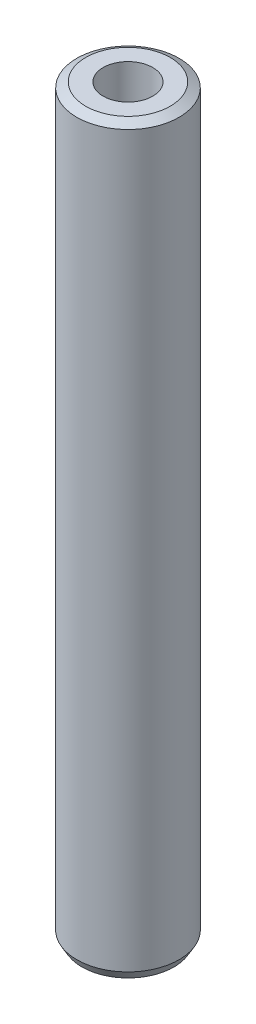
ISO-10303-21;
HEADER;
FILE_DESCRIPTION(('STEP AP214'),'2;1');
FILE_NAME('part.step','',(''),(''),'','','');
FILE_SCHEMA(('AUTOMOTIVE_DESIGN { 1 0 10303 214 1 1 1 1 }'));
ENDSEC;
DATA;
#1=APPLICATION_CONTEXT('core data for automotive mechanical design processes');
#2=APPLICATION_PROTOCOL_DEFINITION('international standard','automotive_design',2000,#1);
#3=PRODUCT_CONTEXT('',#1,'mechanical');
#4=PRODUCT('Part','Part','',(#3));
#5=PRODUCT_RELATED_PRODUCT_CATEGORY('part','',(#4));
#6=PRODUCT_DEFINITION_FORMATION('','',#4);
#7=PRODUCT_DEFINITION_CONTEXT('part definition',#1,'design');
#8=PRODUCT_DEFINITION('design','',#6,#7);
#9=PRODUCT_DEFINITION_SHAPE('','',#8);
#10=(LENGTH_UNIT() NAMED_UNIT(*) SI_UNIT(.MILLI.,.METRE.));
#11=(NAMED_UNIT(*) PLANE_ANGLE_UNIT() SI_UNIT($,.RADIAN.));
#12=(NAMED_UNIT(*) SI_UNIT($,.STERADIAN.) SOLID_ANGLE_UNIT());
#13=UNCERTAINTY_MEASURE_WITH_UNIT(LENGTH_MEASURE(1.E-05),#10,'distance_accuracy_value','');
#14=(GEOMETRIC_REPRESENTATION_CONTEXT(3) GLOBAL_UNCERTAINTY_ASSIGNED_CONTEXT((#13)) GLOBAL_UNIT_ASSIGNED_CONTEXT((#10,
#11,#12)) REPRESENTATION_CONTEXT('',''));
#15=CARTESIAN_POINT('',(0.,0.,0.));
#16=DIRECTION('',(0.,0.,1.));
#17=DIRECTION('',(1.,0.,0.));
#18=AXIS2_PLACEMENT_3D('',#15,#16,#17);
#19=CARTESIAN_POINT('',(0.,72.6724296068115,0.));
#20=DIRECTION('',(0.,-1.,0.));
#21=DIRECTION('',(0.,0.,-1.));
#22=AXIS2_PLACEMENT_3D('',#19,#20,#21);
#23=CYLINDRICAL_SURFACE('',#22,5.);
#24=CARTESIAN_POINT('',(0.,72.1707802732343,0.));
#25=DIRECTION('',(0.,1.,0.));
#26=DIRECTION('',(0.,0.,1.));
#27=AXIS2_PLACEMENT_3D('',#24,#25,#26);
#28=CIRCLE('',#27,5.);
#29=CARTESIAN_POINT('',(0.,72.1707802732343,5.));
#30=VERTEX_POINT('',#29);
#31=EDGE_CURVE('E50',#30,#30,#28,.F.);
#32=ORIENTED_EDGE('',*,*,#31,.T.);
#33=EDGE_LOOP('',(#32));
#34=FACE_BOUND('',#33,.T.);
#35=CARTESIAN_POINT('',(0.,0.86888213333873,0.));
#36=DIRECTION('',(0.,1.,0.));
#37=DIRECTION('',(0.,0.,1.));
#38=AXIS2_PLACEMENT_3D('',#35,#36,#37);
#39=CIRCLE('',#38,5.);
#40=CARTESIAN_POINT('',(0.,0.86888213333873,5.));
#41=VERTEX_POINT('',#40);
#42=EDGE_CURVE('E51',#41,#41,#39,.T.);
#43=ORIENTED_EDGE('',*,*,#42,.T.);
#44=EDGE_LOOP('',(#43));
#45=FACE_BOUND('',#44,.T.);
#46=ADVANCED_FACE('F39',(#34,#45),#23,.T.);
#47=CARTESIAN_POINT('',(0.,72.6724296068115,0.));
#48=DIRECTION('',(0.,1.,0.));
#49=DIRECTION('',(0.,0.,1.));
#50=AXIS2_PLACEMENT_3D('',#47,#48,#49);
#51=PLANE('',#50);
#52=CARTESIAN_POINT('',(0.,72.6724296068115,0.));
#53=DIRECTION('',(0.,1.,0.));
#54=DIRECTION('',(0.,0.,1.));
#55=AXIS2_PLACEMENT_3D('',#52,#53,#54);
#56=CIRCLE('',#55,4.13111786666123);
#57=CARTESIAN_POINT('',(0.,72.6724296068115,4.13111786666123));
#58=VERTEX_POINT('',#57);
#59=EDGE_CURVE('E54',#58,#58,#56,.T.);
#60=ORIENTED_EDGE('',*,*,#59,.T.);
#61=EDGE_LOOP('',(#60));
#62=FACE_BOUND('',#61,.T.);
#63=CARTESIAN_POINT('',(0.,72.6724296068115,0.));
#64=DIRECTION('',(0.,1.,0.));
#65=DIRECTION('',(0.,0.,1.));
#66=AXIS2_PLACEMENT_3D('',#63,#64,#65);
#67=CIRCLE('',#66,2.42620578799193);
#68=CARTESIAN_POINT('',(0.,72.6724296068115,2.42620578799193));
#69=VERTEX_POINT('',#68);
#70=EDGE_CURVE('E58',#69,#69,#67,.T.);
#71=ORIENTED_EDGE('',*,*,#70,.F.);
#72=EDGE_LOOP('',(#71));
#73=FACE_BOUND('',#72,.T.);
#74=ADVANCED_FACE('F69',(#62,#73),#51,.T.);
#75=CARTESIAN_POINT('',(0.,0.,0.));
#76=DIRECTION('',(0.,1.,0.));
#77=DIRECTION('',(0.,0.,1.));
#78=AXIS2_PLACEMENT_3D('',#75,#76,#77);
#79=PLANE('',#78);
#80=CARTESIAN_POINT('',(0.,0.,0.));
#81=DIRECTION('',(0.,1.,0.));
#82=DIRECTION('',(0.,0.,1.));
#83=AXIS2_PLACEMENT_3D('',#80,#81,#82);
#84=CIRCLE('',#83,4.49835066642282);
#85=CARTESIAN_POINT('',(0.,0.,4.49835066642282));
#86=VERTEX_POINT('',#85);
#87=EDGE_CURVE('E10',#86,#86,#84,.F.);
#88=ORIENTED_EDGE('',*,*,#87,.T.);
#89=EDGE_LOOP('',(#88));
#90=FACE_BOUND('',#89,.T.);
#91=CARTESIAN_POINT('',(0.,0.,0.));
#92=DIRECTION('',(0.,1.,0.));
#93=DIRECTION('',(0.,0.,1.));
#94=AXIS2_PLACEMENT_3D('',#91,#92,#93);
#95=CIRCLE('',#94,2.42620578799193);
#96=CARTESIAN_POINT('',(0.,0.,2.42620578799193));
#97=VERTEX_POINT('',#96);
#98=EDGE_CURVE('E63',#97,#97,#95,.T.);
#99=ORIENTED_EDGE('',*,*,#98,.T.);
#100=EDGE_LOOP('',(#99));
#101=FACE_BOUND('',#100,.T.);
#102=ADVANCED_FACE('F75',(#90,#101),#79,.F.);
#103=CARTESIAN_POINT('',(0.,72.6724296068115,0.));
#104=DIRECTION('',(0.,-1.,0.));
#105=DIRECTION('',(0.,0.,-1.));
#106=AXIS2_PLACEMENT_3D('',#103,#104,#105);
#107=CYLINDRICAL_SURFACE('',#106,2.42620578799193);
#108=ORIENTED_EDGE('',*,*,#70,.T.);
#109=EDGE_LOOP('',(#108));
#110=FACE_BOUND('',#109,.T.);
#111=ORIENTED_EDGE('',*,*,#98,.F.);
#112=EDGE_LOOP('',(#111));
#113=FACE_BOUND('',#112,.T.);
#114=ADVANCED_FACE('F70',(#110,#113),#107,.F.);
#115=CARTESIAN_POINT('',(0.,72.6724296068115,0.));
#116=DIRECTION('',(0.,-1.,0.));
#117=DIRECTION('',(0.,0.,-1.));
#118=AXIS2_PLACEMENT_3D('',#115,#116,#117);
#119=CONICAL_SURFACE('',#118,4.13111786666123,1.04719755119659);
#120=ORIENTED_EDGE('',*,*,#31,.F.);
#121=EDGE_LOOP('',(#120));
#122=FACE_BOUND('',#121,.T.);
#123=ORIENTED_EDGE('',*,*,#59,.F.);
#124=EDGE_LOOP('',(#123));
#125=FACE_BOUND('',#124,.T.);
#126=ADVANCED_FACE('F81',(#122,#125),#119,.T.);
#127=CARTESIAN_POINT('',(0.,0.86888213333873,0.));
#128=DIRECTION('',(0.,1.,0.));
#129=DIRECTION('',(0.,0.,1.));
#130=AXIS2_PLACEMENT_3D('',#127,#128,#129);
#131=CONICAL_SURFACE('',#130,5.,0.523598775598301);
#132=CARTESIAN_POINT('',(0.,0.,4.49835066642282));
#133=CARTESIAN_POINT('',(0.,0.00905085555561176,4.50357618031425));
#134=CARTESIAN_POINT('',(0.,0.0181017111112235,4.50880169420568));
#135=CARTESIAN_POINT('',(0.,0.036203422222447,4.51925272198854));
#136=CARTESIAN_POINT('',(0.,0.0452542777780588,4.52447823587997));
#137=CARTESIAN_POINT('',(0.,0.0633559888892823,4.53492926366283));
#138=CARTESIAN_POINT('',(0.,0.072406844444894,4.54015477755426));
#139=CARTESIAN_POINT('',(0.,0.0905085555561176,4.55060580533711));
#140=CARTESIAN_POINT('',(0.,0.0995594111117294,4.55583131922854));
#141=CARTESIAN_POINT('',(0.,0.117661122222953,4.5662823470114));
#142=CARTESIAN_POINT('',(0.,0.126711977778565,4.57150786090283));
#143=CARTESIAN_POINT('',(0.,0.144813688889788,4.58195888868569));
#144=CARTESIAN_POINT('',(0.,0.1538645444454,4.58718440257712));
#145=CARTESIAN_POINT('',(0.,0.171966255556624,4.59763543035997));
#146=CARTESIAN_POINT('',(0.,0.181017111112235,4.6028609442514));
#147=CARTESIAN_POINT('',(0.,0.199118822223459,4.61331197203426));
#148=CARTESIAN_POINT('',(0.,0.208169677779071,4.61853748592569));
#149=CARTESIAN_POINT('',(0.,0.226271388890294,4.62898851370855));
#150=CARTESIAN_POINT('',(0.,0.235322244445906,4.63421402759998));
#151=CARTESIAN_POINT('',(0.,0.25342395555713,4.64466505538283));
#152=CARTESIAN_POINT('',(0.,0.262474811112741,4.64989056927426));
#153=CARTESIAN_POINT('',(0.,0.280576522223965,4.66034159705712));
#154=CARTESIAN_POINT('',(0.,0.289627377779577,4.66556711094855));
#155=CARTESIAN_POINT('',(0.,0.3077290888908,4.67601813873141));
#156=CARTESIAN_POINT('',(0.,0.316779944446412,4.68124365262284));
#157=CARTESIAN_POINT('',(0.,0.334881655557635,4.69169468040569));
#158=CARTESIAN_POINT('',(0.,0.343932511113247,4.69692019429712));
#159=CARTESIAN_POINT('',(0.,0.362034222224471,4.70737122207998));
#160=CARTESIAN_POINT('',(0.,0.371085077780083,4.71259673597141));
#161=CARTESIAN_POINT('',(0.,0.389186788891306,4.72304776375427));
#162=CARTESIAN_POINT('',(0.,0.398237644446918,4.7282732776457));
#163=CARTESIAN_POINT('',(0.,0.416339355558141,4.73872430542855));
#164=CARTESIAN_POINT('',(0.,0.425390211113753,4.74394981931998));
#165=CARTESIAN_POINT('',(0.,0.443491922224977,4.75440084710284));
#166=CARTESIAN_POINT('',(0.,0.452542777780589,4.75962636099427));
#167=CARTESIAN_POINT('',(0.,0.470644488891812,4.77007738877713));
#168=CARTESIAN_POINT('',(0.,0.479695344447424,4.77530290266856));
#169=CARTESIAN_POINT('',(0.,0.497797055558648,4.78575393045142));
#170=CARTESIAN_POINT('',(0.,0.506847911114259,4.79097944434284));
#171=CARTESIAN_POINT('',(0.,0.524949622225483,4.8014304721257));
#172=CARTESIAN_POINT('',(0.,0.534000477781095,4.80665598601713));
#173=CARTESIAN_POINT('',(0.,0.552102188892318,4.81710701379999));
#174=CARTESIAN_POINT('',(0.,0.56115304444793,4.82233252769142));
#175=CARTESIAN_POINT('',(0.,0.579254755559154,4.83278355547427));
#176=CARTESIAN_POINT('',(0.,0.588305611114765,4.8380090693657));
#177=CARTESIAN_POINT('',(0.,0.606407322225989,4.84846009714856));
#178=CARTESIAN_POINT('',(0.,0.615458177781601,4.85368561103999));
#179=CARTESIAN_POINT('',(0.,0.633559888892824,4.86413663882285));
#180=CARTESIAN_POINT('',(0.,0.642610744448436,4.86936215271428));
#181=CARTESIAN_POINT('',(0.,0.66071245555966,4.87981318049713));
#182=CARTESIAN_POINT('',(0.,0.669763311115271,4.88503869438856));
#183=CARTESIAN_POINT('',(0.,0.687865022226495,4.89548972217142));
#184=CARTESIAN_POINT('',(0.,0.696915877782107,4.90071523606285));
#185=CARTESIAN_POINT('',(0.,0.71501758889333,4.91116626384571));
#186=CARTESIAN_POINT('',(0.,0.724068444448942,4.91639177773714));
#187=CARTESIAN_POINT('',(0.,0.742170155560165,4.92684280552));
#188=CARTESIAN_POINT('',(0.,0.751221011115777,4.93206831941142));
#189=CARTESIAN_POINT('',(0.,0.769322722227001,4.94251934719428));
#190=CARTESIAN_POINT('',(0.,0.778373577782613,4.94774486108571));
#191=CARTESIAN_POINT('',(0.,0.796475288893836,4.95819588886857));
#192=CARTESIAN_POINT('',(0.,0.805526144449448,4.96342140276));
#193=CARTESIAN_POINT('',(0.,0.823627855560671,4.97387243054286));
#194=CARTESIAN_POINT('',(0.,0.832678711116283,4.97909794443428));
#195=CARTESIAN_POINT('',(0.,0.850780422227507,4.98954897221714));
#196=CARTESIAN_POINT('',(0.,0.859831277783119,4.99477448610857));
#197=CARTESIAN_POINT('',(0.,0.86888213333873,5.));
#198=B_SPLINE_CURVE_WITH_KNOTS('',3,(#132,#133,#134,#135,#136,#137,#138,#139,#140,#141,#142,
#143,#144,#145,#146,#147,#148,#149,#150,#151,#152,#153,#154,#155,#156,#157,#158,#159,#160,#161,
#162,#163,#164,#165,#166,#167,#168,#169,#170,#171,#172,#173,#174,#175,#176,#177,#178,#179,#180,
#181,#182,#183,#184,#185,#186,#187,#188,#189,#190,#191,#192,#193,#194,#195,#196,#197),
.UNSPECIFIED.,.F.,.F.,(4,2,2,2,2,2,2,2,2,2,2,2,2,2,2,2,2,2,2,2,2,2,2,2,2,2,2,2,2,2,2,2,4),(0.,
0.0313530833485731,0.0627061666971465,0.09405925004572,0.125412333394293,0.156765416742867,
0.18811850009144,0.219471583440013,0.250824666788587,0.28217775013716,0.313530833485733,
0.344883916834306,0.37623700018288,0.407590083531453,0.438943166880026,0.4702962502286,
0.501649333577173,0.533002416925746,0.56435550027432,0.595708583622893,0.627061666971467,
0.65841475032004,0.689767833668613,0.721120917017187,0.75247400036576,0.783827083714333,
0.815180167062906,0.84653325041148,0.877886333760053,0.909239417108626,0.9405925004572,
0.971945583805773,1.00329866715435),.UNSPECIFIED.);
#199=EDGE_CURVE('BSEAM45',#86,#41,#198,.T.);
#200=ORIENTED_EDGE('',*,*,#87,.F.);
#201=ORIENTED_EDGE('',*,*,#42,.F.);
#202=ORIENTED_EDGE('',*,*,#199,.T.);
#203=ORIENTED_EDGE('',*,*,#199,.F.);
#204=EDGE_LOOP('',(#200,#202,#201,#203));
#205=FACE_BOUND('',#204,.T.);
#206=ADVANCED_FACE('F45',(#205),#131,.T.);
#207=CLOSED_SHELL('',(#46,#74,#102,#114,#126,#206));
#208=MANIFOLD_SOLID_BREP('B2',#207);
#209=ADVANCED_BREP_SHAPE_REPRESENTATION('',(#18,#208),#14);
#210=SHAPE_DEFINITION_REPRESENTATION(#9,#209);
ENDSEC;
END-ISO-10303-21;
